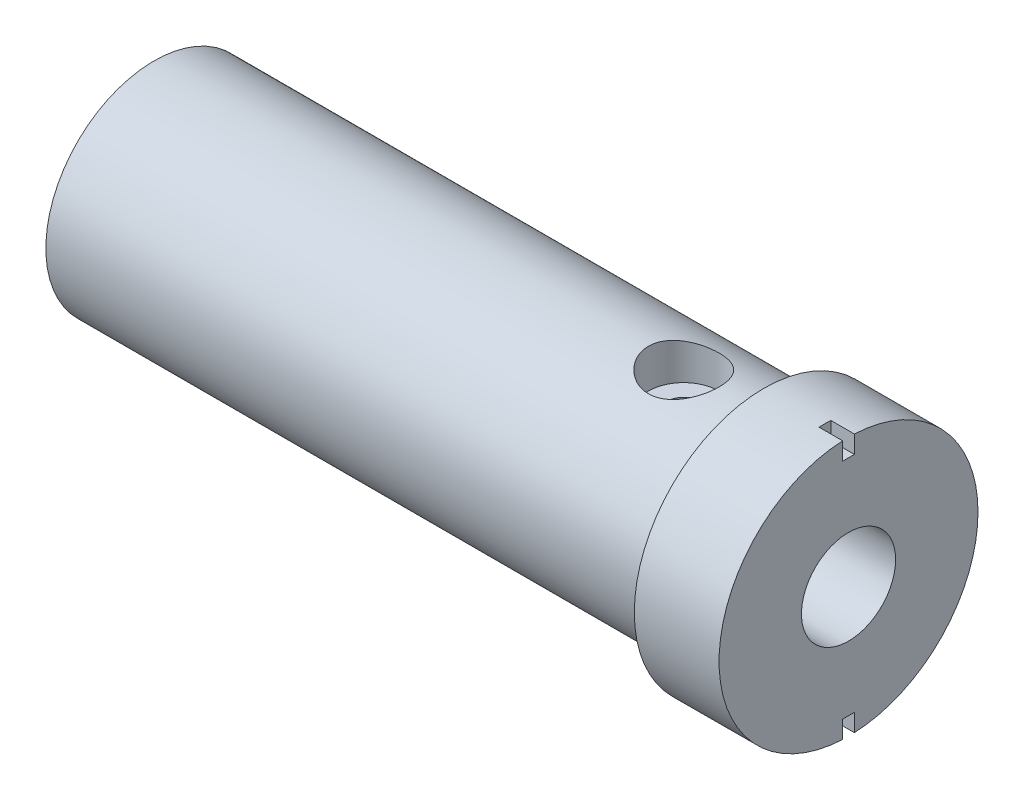
ISO-10303-21;
HEADER;
FILE_DESCRIPTION(('STEP AP214'),'2;1');
FILE_NAME('part.step','',(''),(''),'','','');
FILE_SCHEMA(('AUTOMOTIVE_DESIGN { 1 0 10303 214 1 1 1 1 }'));
ENDSEC;
DATA;
#1=APPLICATION_CONTEXT('core data for automotive mechanical design processes');
#2=APPLICATION_PROTOCOL_DEFINITION('international standard','automotive_design',2000,#1);
#3=PRODUCT_CONTEXT('',#1,'mechanical');
#4=PRODUCT('Part','Part','',(#3));
#5=PRODUCT_RELATED_PRODUCT_CATEGORY('part','',(#4));
#6=PRODUCT_DEFINITION_FORMATION('','',#4);
#7=PRODUCT_DEFINITION_CONTEXT('part definition',#1,'design');
#8=PRODUCT_DEFINITION('design','',#6,#7);
#9=PRODUCT_DEFINITION_SHAPE('','',#8);
#10=(LENGTH_UNIT() NAMED_UNIT(*) SI_UNIT(.MILLI.,.METRE.));
#11=(NAMED_UNIT(*) PLANE_ANGLE_UNIT() SI_UNIT($,.RADIAN.));
#12=(NAMED_UNIT(*) SI_UNIT($,.STERADIAN.) SOLID_ANGLE_UNIT());
#13=UNCERTAINTY_MEASURE_WITH_UNIT(LENGTH_MEASURE(1.E-05),#10,'distance_accuracy_value','');
#14=(GEOMETRIC_REPRESENTATION_CONTEXT(3) GLOBAL_UNCERTAINTY_ASSIGNED_CONTEXT((#13)) GLOBAL_UNIT_ASSIGNED_CONTEXT((#10,
#11,#12)) REPRESENTATION_CONTEXT('',''));
#15=CARTESIAN_POINT('',(0.,0.,0.));
#16=DIRECTION('',(0.,0.,1.));
#17=DIRECTION('',(1.,0.,0.));
#18=AXIS2_PLACEMENT_3D('',#15,#16,#17);
#19=CARTESIAN_POINT('',(0.,0.,0.));
#20=DIRECTION('',(1.,0.,0.));
#21=DIRECTION('',(0.,0.,-1.));
#22=AXIS2_PLACEMENT_3D('',#19,#20,#21);
#23=PLANE('',#22);
#24=CARTESIAN_POINT('',(0.,0.,0.));
#25=DIRECTION('',(1.,0.,0.));
#26=DIRECTION('',(0.,0.,-1.));
#27=AXIS2_PLACEMENT_3D('',#24,#25,#26);
#28=CIRCLE('',#27,4.);
#29=CARTESIAN_POINT('',(0.,0.,-4.));
#30=VERTEX_POINT('',#29);
#31=EDGE_CURVE('E194',#30,#30,#28,.T.);
#32=ORIENTED_EDGE('',*,*,#31,.F.);
#33=EDGE_LOOP('',(#32));
#34=FACE_BOUND('',#33,.T.);
#35=DIRECTION('',(0.,0.,1.));
#36=VECTOR('',#35,1.);
#37=CARTESIAN_POINT('',(0.,9.48863048791795,0.));
#38=LINE('',#37,#36);
#39=CARTESIAN_POINT('',(0.,9.48863048791795,-0.499999999999999));
#40=VERTEX_POINT('',#39);
#41=CARTESIAN_POINT('',(0.,9.48863048791795,0.500000000000001));
#42=VERTEX_POINT('',#41);
#43=EDGE_CURVE('E143',#40,#42,#38,.T.);
#44=ORIENTED_EDGE('',*,*,#43,.T.);
#45=DIRECTION('',(0.,1.,0.));
#46=VECTOR('',#45,1.);
#47=CARTESIAN_POINT('',(0.,0.,0.500000000000001));
#48=LINE('',#47,#46);
#49=CARTESIAN_POINT('',(0.,10.988630487918,0.500000000000001));
#50=VERTEX_POINT('',#49);
#51=EDGE_CURVE('E133',#42,#50,#48,.T.);
#52=ORIENTED_EDGE('',*,*,#51,.T.);
#53=CARTESIAN_POINT('',(0.,0.,0.));
#54=DIRECTION('',(1.,0.,0.));
#55=DIRECTION('',(0.,0.,-1.));
#56=AXIS2_PLACEMENT_3D('',#53,#54,#55);
#57=CIRCLE('',#56,11.);
#58=CARTESIAN_POINT('',(0.,-10.988630487918,0.500000000000001));
#59=VERTEX_POINT('',#58);
#60=EDGE_CURVE('E11',#50,#59,#57,.T.);
#61=ORIENTED_EDGE('',*,*,#60,.T.);
#62=DIRECTION('',(0.,-1.,0.));
#63=VECTOR('',#62,1.);
#64=CARTESIAN_POINT('',(0.,0.,0.500000000000001));
#65=LINE('',#64,#63);
#66=CARTESIAN_POINT('',(0.,-9.48863048791795,0.500000000000001));
#67=VERTEX_POINT('',#66);
#68=EDGE_CURVE('E161',#67,#59,#65,.T.);
#69=ORIENTED_EDGE('',*,*,#68,.F.);
#70=DIRECTION('',(0.,0.,1.));
#71=VECTOR('',#70,1.);
#72=CARTESIAN_POINT('',(0.,-9.48863048791795,0.));
#73=LINE('',#72,#71);
#74=CARTESIAN_POINT('',(0.,-9.48863048791795,-0.499999999999999));
#75=VERTEX_POINT('',#74);
#76=EDGE_CURVE('E171',#75,#67,#73,.T.);
#77=ORIENTED_EDGE('',*,*,#76,.F.);
#78=DIRECTION('',(0.,1.,0.));
#79=VECTOR('',#78,1.);
#80=CARTESIAN_POINT('',(0.,0.,-0.5));
#81=LINE('',#80,#79);
#82=CARTESIAN_POINT('',(0.,-10.988630487918,-0.499999999999999));
#83=VERTEX_POINT('',#82);
#84=EDGE_CURVE('E168',#83,#75,#81,.T.);
#85=ORIENTED_EDGE('',*,*,#84,.F.);
#86=CARTESIAN_POINT('',(0.,10.988630487918,-0.499999999999999));
#87=VERTEX_POINT('',#86);
#88=EDGE_CURVE('E49',#83,#87,#57,.T.);
#89=ORIENTED_EDGE('',*,*,#88,.T.);
#90=DIRECTION('',(0.,-1.,0.));
#91=VECTOR('',#90,1.);
#92=CARTESIAN_POINT('',(0.,0.,-0.5));
#93=LINE('',#92,#91);
#94=EDGE_CURVE('E140',#87,#40,#93,.T.);
#95=ORIENTED_EDGE('',*,*,#94,.T.);
#96=EDGE_LOOP('',(#44,#52,#61,#69,#77,#85,#89,#95));
#97=FACE_BOUND('',#96,.T.);
#98=ADVANCED_FACE('F36',(#34,#97),#23,.T.);
#99=CARTESIAN_POINT('',(0.,0.,0.));
#100=DIRECTION('',(1.,0.,0.));
#101=DIRECTION('',(0.,0.,-1.));
#102=AXIS2_PLACEMENT_3D('',#99,#100,#101);
#103=CYLINDRICAL_SURFACE('',#102,11.);
#104=CARTESIAN_POINT('',(-7.2,0.,0.));
#105=DIRECTION('',(1.,0.,0.));
#106=DIRECTION('',(0.,0.,-1.));
#107=AXIS2_PLACEMENT_3D('',#104,#105,#106);
#108=CIRCLE('',#107,11.);
#109=CARTESIAN_POINT('',(-7.2,0.,-11.));
#110=VERTEX_POINT('',#109);
#111=EDGE_CURVE('E214',#110,#110,#108,.T.);
#112=ORIENTED_EDGE('',*,*,#111,.T.);
#113=EDGE_LOOP('',(#112));
#114=FACE_BOUND('',#113,.T.);
#115=ORIENTED_EDGE('',*,*,#60,.F.);
#116=DIRECTION('',(1.,0.,0.));
#117=VECTOR('',#116,1.);
#118=CARTESIAN_POINT('',(-2.,10.988630487918,0.500000000000001));
#119=LINE('',#118,#117);
#120=CARTESIAN_POINT('',(-2.,10.988630487918,0.500000000000001));
#121=VERTEX_POINT('',#120);
#122=EDGE_CURVE('E151',#121,#50,#119,.T.);
#123=ORIENTED_EDGE('',*,*,#122,.F.);
#124=CARTESIAN_POINT('',(-2.,0.,0.));
#125=DIRECTION('',(1.,0.,0.));
#126=DIRECTION('',(0.,0.,-1.));
#127=AXIS2_PLACEMENT_3D('',#124,#125,#126);
#128=CIRCLE('',#127,11.);
#129=CARTESIAN_POINT('',(-2.,10.988630487918,-0.499999999999999));
#130=VERTEX_POINT('',#129);
#131=EDGE_CURVE('E135',#130,#121,#128,.T.);
#132=ORIENTED_EDGE('',*,*,#131,.F.);
#133=DIRECTION('',(1.,0.,0.));
#134=VECTOR('',#133,1.);
#135=CARTESIAN_POINT('',(-2.,10.988630487918,-0.499999999999999));
#136=LINE('',#135,#134);
#137=EDGE_CURVE('E154',#130,#87,#136,.T.);
#138=ORIENTED_EDGE('',*,*,#137,.T.);
#139=ORIENTED_EDGE('',*,*,#88,.F.);
#140=DIRECTION('',(1.,0.,0.));
#141=VECTOR('',#140,1.);
#142=CARTESIAN_POINT('',(-2.,-10.988630487918,-0.499999999999999));
#143=LINE('',#142,#141);
#144=CARTESIAN_POINT('',(-2.,-10.988630487918,-0.499999999999999));
#145=VERTEX_POINT('',#144);
#146=EDGE_CURVE('E167',#145,#83,#143,.T.);
#147=ORIENTED_EDGE('',*,*,#146,.F.);
#148=CARTESIAN_POINT('',(-2.,0.,0.));
#149=DIRECTION('',(1.,0.,0.));
#150=DIRECTION('',(0.,0.,-1.));
#151=AXIS2_PLACEMENT_3D('',#148,#149,#150);
#152=CIRCLE('',#151,11.);
#153=CARTESIAN_POINT('',(-2.,-10.988630487918,0.500000000000001));
#154=VERTEX_POINT('',#153);
#155=EDGE_CURVE('E158',#154,#145,#152,.T.);
#156=ORIENTED_EDGE('',*,*,#155,.F.);
#157=DIRECTION('',(1.,0.,0.));
#158=VECTOR('',#157,1.);
#159=CARTESIAN_POINT('',(-2.,-10.988630487918,0.500000000000001));
#160=LINE('',#159,#158);
#161=EDGE_CURVE('E149',#154,#59,#160,.T.);
#162=ORIENTED_EDGE('',*,*,#161,.T.);
#163=EDGE_LOOP('',(#115,#123,#132,#138,#139,#147,#156,#162));
#164=FACE_BOUND('',#163,.T.);
#165=ADVANCED_FACE('F224',(#114,#164),#103,.T.);
#166=CARTESIAN_POINT('',(-21.,3.1,0.));
#167=DIRECTION('',(0.,-1.,0.));
#168=DIRECTION('',(0.,0.,-1.));
#169=AXIS2_PLACEMENT_3D('',#166,#167,#168);
#170=PLANE('',#169);
#171=CARTESIAN_POINT('',(-14.,3.1,0.));
#172=DIRECTION('',(0.,-1.,0.));
#173=DIRECTION('',(0.,0.,-1.));
#174=AXIS2_PLACEMENT_3D('',#171,#172,#173);
#175=CIRCLE('',#174,1.475);
#176=CARTESIAN_POINT('',(-14.,3.1,-1.475));
#177=VERTEX_POINT('',#176);
#178=EDGE_CURVE('E187',#177,#177,#175,.T.);
#179=ORIENTED_EDGE('',*,*,#178,.F.);
#180=EDGE_LOOP('',(#179));
#181=FACE_BOUND('',#180,.T.);
#182=DIRECTION('',(1.,0.,0.));
#183=VECTOR('',#182,1.);
#184=CARTESIAN_POINT('',(-21.,3.1,-2.52784493195291));
#185=LINE('',#184,#183);
#186=CARTESIAN_POINT('',(-21.,3.1,-2.52784493195291));
#187=VERTEX_POINT('',#186);
#188=CARTESIAN_POINT('',(-2.,3.1,-2.52784493195291));
#189=VERTEX_POINT('',#188);
#190=EDGE_CURVE('E200',#187,#189,#185,.T.);
#191=ORIENTED_EDGE('',*,*,#190,.T.);
#192=DIRECTION('',(0.,0.,-1.));
#193=VECTOR('',#192,1.);
#194=CARTESIAN_POINT('',(-2.,3.1,0.));
#195=LINE('',#194,#193);
#196=CARTESIAN_POINT('',(-2.00000000000001,3.1,2.52784493195291));
#197=VERTEX_POINT('',#196);
#198=EDGE_CURVE('E190',#197,#189,#195,.T.);
#199=ORIENTED_EDGE('',*,*,#198,.F.);
#200=DIRECTION('',(1.,0.,0.));
#201=VECTOR('',#200,1.);
#202=CARTESIAN_POINT('',(-21.,3.1,2.52784493195291));
#203=LINE('',#202,#201);
#204=CARTESIAN_POINT('',(-21.,3.1,2.52784493195291));
#205=VERTEX_POINT('',#204);
#206=EDGE_CURVE('E203',#205,#197,#203,.T.);
#207=ORIENTED_EDGE('',*,*,#206,.F.);
#208=DIRECTION('',(0.,0.,-1.));
#209=VECTOR('',#208,1.);
#210=CARTESIAN_POINT('',(-21.,3.1,0.));
#211=LINE('',#210,#209);
#212=EDGE_CURVE('E198',#205,#187,#211,.T.);
#213=ORIENTED_EDGE('',*,*,#212,.T.);
#214=EDGE_LOOP('',(#191,#199,#207,#213));
#215=FACE_BOUND('',#214,.T.);
#216=ADVANCED_FACE('F251',(#181,#215),#170,.T.);
#217=CARTESIAN_POINT('',(-7.2,0.,-11.));
#218=DIRECTION('',(-1.,0.,0.));
#219=DIRECTION('',(0.,0.,1.));
#220=AXIS2_PLACEMENT_3D('',#217,#218,#219);
#221=PLANE('',#220);
#222=CARTESIAN_POINT('',(-7.2,0.,0.));
#223=DIRECTION('',(1.,0.,0.));
#224=DIRECTION('',(0.,0.,-1.));
#225=AXIS2_PLACEMENT_3D('',#222,#223,#224);
#226=CIRCLE('',#225,9.2);
#227=CARTESIAN_POINT('',(-7.2,0.,-9.2));
#228=VERTEX_POINT('',#227);
#229=EDGE_CURVE('E211',#228,#228,#226,.T.);
#230=ORIENTED_EDGE('',*,*,#229,.T.);
#231=EDGE_LOOP('',(#230));
#232=FACE_BOUND('',#231,.T.);
#233=ORIENTED_EDGE('',*,*,#111,.F.);
#234=EDGE_LOOP('',(#233));
#235=FACE_BOUND('',#234,.T.);
#236=ADVANCED_FACE('F280',(#232,#235),#221,.T.);
#237=CARTESIAN_POINT('',(0.,0.,0.));
#238=DIRECTION('',(1.,0.,0.));
#239=DIRECTION('',(0.,0.,-1.));
#240=AXIS2_PLACEMENT_3D('',#237,#238,#239);
#241=CYLINDRICAL_SURFACE('',#240,9.19999999999999);
#242=CARTESIAN_POINT('',(-14.,8.69712596206355,-3.));
#243=CARTESIAN_POINT('',(-14.1636280358255,8.69712602561283,-3.00000006948844));
#244=CARTESIAN_POINT('',(-14.3272570951127,8.70179420906425,-2.98656760005086));
#245=CARTESIAN_POINT('',(-14.6496818341707,8.7198707417757,-2.93336401551207));
#246=CARTESIAN_POINT('',(-14.8084765350284,8.73328084903519,-2.89358760262238));
#247=CARTESIAN_POINT('',(-15.1165119476742,8.76716430876783,-2.78923030719512));
#248=CARTESIAN_POINT('',(-15.2657701134439,8.78762429226838,-2.72469634734532));
#249=CARTESIAN_POINT('',(-15.5513872146714,8.83328304536185,-2.57281482250126));
#250=CARTESIAN_POINT('',(-15.6877434910631,8.85848278863063,-2.48546256857121));
#251=CARTESIAN_POINT('',(-15.9487896804251,8.91183948555475,-2.28692219691646));
#252=CARTESIAN_POINT('',(-16.0729260556745,8.94006780908053,-2.17502527730267));
#253=CARTESIAN_POINT('',(-16.3010465897289,8.99569637021583,-1.93208603100607));
#254=CARTESIAN_POINT('',(-16.4050276666717,9.02309648064696,-1.80104078179667));
#255=CARTESIAN_POINT('',(-16.5923730486131,9.07480417137145,-1.51950174610698));
#256=CARTESIAN_POINT('',(-16.6751608891587,9.09901799471419,-1.36860562348149));
#257=CARTESIAN_POINT('',(-16.8139621663094,9.14078660779368,-1.05410527392676));
#258=CARTESIAN_POINT('',(-16.8699824895143,9.15834311004922,-0.890504328230102));
#259=CARTESIAN_POINT('',(-16.9517916678518,9.18431353905577,-0.561039311526713));
#260=CARTESIAN_POINT('',(-16.978528010398,9.19301331783793,-0.395433460298396));
#261=CARTESIAN_POINT('',(-17.0040191771576,9.2013029471673,-0.0618729536399199));
#262=CARTESIAN_POINT('',(-17.0027809107984,9.20089504721341,0.106081111564881));
#263=CARTESIAN_POINT('',(-16.9729669050479,9.19121087856134,0.432877467383251));
#264=CARTESIAN_POINT('',(-16.9454195698059,9.18226823639605,0.591825072105986));
#265=CARTESIAN_POINT('',(-16.8654653636474,9.15693522813862,0.90270371353502));
#266=CARTESIAN_POINT('',(-16.8130568279354,9.1405443632898,1.0546342796074));
#267=CARTESIAN_POINT('',(-16.6842463234534,9.10172363407732,1.34945857551705));
#268=CARTESIAN_POINT('',(-16.6075448709107,9.07921891922917,1.49221119656913));
#269=CARTESIAN_POINT('',(-16.4325702225646,9.03052321490297,1.76312900882243));
#270=CARTESIAN_POINT('',(-16.3342912140292,9.00433123280328,1.8912902551296));
#271=CARTESIAN_POINT('',(-16.1137339327142,8.94963510368291,2.13551054636341));
#272=CARTESIAN_POINT('',(-15.9905720673065,8.92107995667197,2.25076133825675));
#273=CARTESIAN_POINT('',(-15.7264169773515,8.86588177281267,2.45922724376976));
#274=CARTESIAN_POINT('',(-15.5854212493852,8.8392390052382,2.55243925842673));
#275=CARTESIAN_POINT('',(-15.2871385440113,8.79061060372585,2.71523620605493));
#276=CARTESIAN_POINT('',(-15.1296620452021,8.76869067896904,2.78449500230246));
#277=CARTESIAN_POINT('',(-14.8043896798805,8.73275371918737,2.89524477566101));
#278=CARTESIAN_POINT('',(-14.6365979456122,8.71873354214059,2.93674679389927));
#279=CARTESIAN_POINT('',(-14.3032574416781,8.70088969109624,2.98919004884247));
#280=CARTESIAN_POINT('',(-14.137927172899,8.69665004268403,3.00137901368447));
#281=CARTESIAN_POINT('',(-13.8075631701979,8.69768729156416,2.99837337293999));
#282=CARTESIAN_POINT('',(-13.6425293902187,8.70296255434456,2.98318347061216));
#283=CARTESIAN_POINT('',(-13.3230098573138,8.72202193994362,2.92697036189824));
#284=CARTESIAN_POINT('',(-13.1683555914896,8.73552500390931,2.88679959741978));
#285=CARTESIAN_POINT('',(-12.868008509431,8.76921338217084,2.78278011008459));
#286=CARTESIAN_POINT('',(-12.7223172431005,8.7893998483471,2.71892730541411));
#287=CARTESIAN_POINT('',(-12.4390828517378,8.83494779646293,2.56712739933201));
#288=CARTESIAN_POINT('',(-12.3019266191577,8.8604489949994,2.47850145430636));
#289=CARTESIAN_POINT('',(-12.0439804013709,8.91347559935073,2.28044848294344));
#290=CARTESIAN_POINT('',(-11.923195056142,8.94100157564942,2.17101558034839));
#291=CARTESIAN_POINT('',(-11.6957153843372,8.99649879773837,1.92850982824102));
#292=CARTESIAN_POINT('',(-11.5899178019309,9.02443286130206,1.79458489750842));
#293=CARTESIAN_POINT('',(-11.4022479110387,9.07635176949049,1.51019887066399));
#294=CARTESIAN_POINT('',(-11.3203746529421,9.10033677084597,1.35973843121036));
#295=CARTESIAN_POINT('',(-11.1836432183854,9.1415331876694,1.04737228527324));
#296=CARTESIAN_POINT('',(-11.1286009095256,9.15879060371627,0.885553564855847));
#297=CARTESIAN_POINT('',(-11.0467222583125,9.18478757011083,0.554286640438633));
#298=CARTESIAN_POINT('',(-11.0198762193927,9.19353004863087,0.384841080192689));
#299=CARTESIAN_POINT('',(-10.9959951676416,9.20130058724371,0.0513507308213604));
#300=CARTESIAN_POINT('',(-10.9976701153204,9.20074903984763,-0.112592918733419));
#301=CARTESIAN_POINT('',(-11.0276234310136,9.19101860788011,-0.437754965054963));
#302=CARTESIAN_POINT('',(-11.0558997951345,9.18184037315992,-0.598973566169313));
#303=CARTESIAN_POINT('',(-11.1374089151614,9.1560347195712,-0.911768497880309));
#304=CARTESIAN_POINT('',(-11.1902700922902,9.13951837084227,-1.06345146731182));
#305=CARTESIAN_POINT('',(-11.3191075264461,9.1007374974658,-1.35585956495554));
#306=CARTESIAN_POINT('',(-11.3950878983052,9.07847194966336,-1.4965827369017));
#307=CARTESIAN_POINT('',(-11.571154364283,9.02950168220742,-1.76858430385069));
#308=CARTESIAN_POINT('',(-11.6720083703938,9.00266622521187,-1.8993418037466));
#309=CARTESIAN_POINT('',(-11.8936361470826,8.94791896179727,-2.14250077887531));
#310=CARTESIAN_POINT('',(-12.0144161334519,8.92000682160158,-2.25489650441818));
#311=CARTESIAN_POINT('',(-12.2778138088629,8.86503012273927,-2.46235668401022));
#312=CARTESIAN_POINT('',(-12.4210739901892,8.8380351013346,-2.55662631922266));
#313=CARTESIAN_POINT('',(-12.7222350444542,8.78923590884106,-2.71967131657978));
#314=CARTESIAN_POINT('',(-12.8801313064778,8.76743011062269,-2.78845467396348));
#315=CARTESIAN_POINT('',(-13.1964816367645,8.73283625684646,-2.89491464128439));
#316=CARTESIAN_POINT('',(-13.3543446016538,8.71958920178867,-2.934197314077));
#317=CARTESIAN_POINT('',(-13.6748056876588,8.70173534997871,-2.9867359611419));
#318=CARTESIAN_POINT('',(-13.8374023385231,8.69712589891445,-2.99999993094914));
#319=CARTESIAN_POINT('',(-14.,8.69712596206355,-3.));
#320=B_SPLINE_CURVE_WITH_KNOTS('',3,(#242,#243,#244,#245,#246,#247,#248,#249,#250,#251,#252,
#253,#254,#255,#256,#257,#258,#259,#260,#261,#262,#263,#264,#265,#266,#267,#268,#269,#270,#271,
#272,#273,#274,#275,#276,#277,#278,#279,#280,#281,#282,#283,#284,#285,#286,#287,#288,#289,#290,
#291,#292,#293,#294,#295,#296,#297,#298,#299,#300,#301,#302,#303,#304,#305,#306,#307,#308,#309,
#310,#311,#312,#313,#314,#315,#316,#317,#318,#319),.UNSPECIFIED.,.T.,.F.,(4,2,2,2,2,2,2,2,2,2,2,
2,2,2,2,2,2,2,2,2,2,2,2,2,2,2,2,2,2,2,2,2,2,2,2,2,2,2,4),(0.,0.490282515204811,
0.980663656572736,1.47011993962961,1.9596768803839,2.46586129965627,2.97212305651692,
3.49096398502884,4.00967135703011,4.51104899920584,5.01230280785484,5.49473204934623,
5.97719360059669,6.46585099045065,6.95464018055548,7.46551015601591,7.97645192433022,
8.49409929484988,9.01154063226241,9.50653342702693,10.0014411979209,10.480323237867,
10.9592878558497,11.4529407663323,11.9467333008874,12.4631024813133,12.9794511630885,
13.4922045912555,14.0047816281003,14.4942383091859,14.9836581222892,15.4659098542283,
15.9482474692103,16.4479124063776,16.9477335068034,17.4660419863822,17.9841877307132,
18.4715326954798,18.9587278758969),.UNSPECIFIED.);
#321=CARTESIAN_POINT('',(-14.,8.69712596206355,-3.));
#322=VERTEX_POINT('',#321);
#323=EDGE_CURVE('E39',#322,#322,#320,.T.);
#324=ORIENTED_EDGE('',*,*,#323,.F.);
#325=EDGE_LOOP('',(#324));
#326=FACE_BOUND('',#325,.T.);
#327=CARTESIAN_POINT('',(-59.,0.,0.));
#328=DIRECTION('',(1.,0.,0.));
#329=DIRECTION('',(0.,0.,-1.));
#330=AXIS2_PLACEMENT_3D('',#327,#328,#329);
#331=CIRCLE('',#330,9.19999999999999);
#332=CARTESIAN_POINT('',(-59.,0.,-9.19999999999999));
#333=VERTEX_POINT('',#332);
#334=EDGE_CURVE('E206',#333,#333,#331,.T.);
#335=ORIENTED_EDGE('',*,*,#334,.T.);
#336=EDGE_LOOP('',(#335));
#337=FACE_BOUND('',#336,.T.);
#338=ORIENTED_EDGE('',*,*,#229,.F.);
#339=EDGE_LOOP('',(#338));
#340=FACE_BOUND('',#339,.T.);
#341=ADVANCED_FACE('F284',(#326,#337,#340),#241,.T.);
#342=CARTESIAN_POINT('',(-59.,0.,-9.19999999999999));
#343=DIRECTION('',(-1.,0.,0.));
#344=DIRECTION('',(0.,0.,1.));
#345=AXIS2_PLACEMENT_3D('',#342,#343,#344);
#346=PLANE('',#345);
#347=ORIENTED_EDGE('',*,*,#334,.F.);
#348=EDGE_LOOP('',(#347));
#349=FACE_BOUND('',#348,.T.);
#350=ADVANCED_FACE('F259',(#349),#346,.T.);
#351=CARTESIAN_POINT('',(-21.,0.,0.));
#352=DIRECTION('',(1.,0.,0.));
#353=DIRECTION('',(0.,0.,-1.));
#354=AXIS2_PLACEMENT_3D('',#351,#352,#353);
#355=CYLINDRICAL_SURFACE('',#354,4.);
#356=ORIENTED_EDGE('',*,*,#31,.T.);
#357=EDGE_LOOP('',(#356));
#358=FACE_BOUND('',#357,.T.);
#359=CARTESIAN_POINT('',(-2.,0.,0.));
#360=DIRECTION('',(1.,0.,0.));
#361=DIRECTION('',(0.,0.,-1.));
#362=AXIS2_PLACEMENT_3D('',#359,#360,#361);
#363=CIRCLE('',#362,4.);
#364=EDGE_CURVE('E192',#189,#197,#363,.T.);
#365=ORIENTED_EDGE('',*,*,#364,.F.);
#366=ORIENTED_EDGE('',*,*,#190,.F.);
#367=CARTESIAN_POINT('',(-21.,0.,0.));
#368=DIRECTION('',(1.,0.,0.));
#369=DIRECTION('',(0.,0.,-1.));
#370=AXIS2_PLACEMENT_3D('',#367,#368,#369);
#371=CIRCLE('',#370,4.);
#372=EDGE_CURVE('E195',#205,#187,#371,.T.);
#373=ORIENTED_EDGE('',*,*,#372,.F.);
#374=ORIENTED_EDGE('',*,*,#206,.T.);
#375=EDGE_LOOP('',(#365,#366,#373,#374));
#376=FACE_BOUND('',#375,.T.);
#377=ADVANCED_FACE('F255',(#358,#376),#355,.F.);
#378=CARTESIAN_POINT('',(-21.,0.,0.));
#379=DIRECTION('',(1.,0.,0.));
#380=DIRECTION('',(0.,0.,-1.));
#381=AXIS2_PLACEMENT_3D('',#378,#379,#380);
#382=PLANE('',#381);
#383=ORIENTED_EDGE('',*,*,#372,.T.);
#384=ORIENTED_EDGE('',*,*,#212,.F.);
#385=EDGE_LOOP('',(#383,#384));
#386=FACE_BOUND('',#385,.T.);
#387=ADVANCED_FACE('F258',(#386),#382,.T.);
#388=CARTESIAN_POINT('',(-2.,0.,0.));
#389=DIRECTION('',(1.,0.,0.));
#390=DIRECTION('',(0.,0.,-1.));
#391=AXIS2_PLACEMENT_3D('',#388,#389,#390);
#392=PLANE('',#391);
#393=ORIENTED_EDGE('',*,*,#198,.T.);
#394=ORIENTED_EDGE('',*,*,#364,.T.);
#395=EDGE_LOOP('',(#393,#394));
#396=FACE_BOUND('',#395,.T.);
#397=ADVANCED_FACE('F270',(#396),#392,.T.);
#398=CARTESIAN_POINT('',(-14.,11.,0.));
#399=DIRECTION('',(0.,-1.,0.));
#400=DIRECTION('',(0.,0.,-1.));
#401=AXIS2_PLACEMENT_3D('',#398,#399,#400);
#402=CYLINDRICAL_SURFACE('',#401,1.475);
#403=CARTESIAN_POINT('',(-14.,5.9,0.));
#404=DIRECTION('',(0.,-1.,0.));
#405=DIRECTION('',(0.,0.,-1.));
#406=AXIS2_PLACEMENT_3D('',#403,#404,#405);
#407=CIRCLE('',#406,1.475);
#408=CARTESIAN_POINT('',(-14.,5.9,-1.475));
#409=VERTEX_POINT('',#408);
#410=EDGE_CURVE('E153',#409,#409,#407,.T.);
#411=ORIENTED_EDGE('',*,*,#410,.F.);
#412=EDGE_LOOP('',(#411));
#413=FACE_BOUND('',#412,.T.);
#414=ORIENTED_EDGE('',*,*,#178,.T.);
#415=EDGE_LOOP('',(#414));
#416=FACE_BOUND('',#415,.T.);
#417=ADVANCED_FACE('F275',(#413,#416),#402,.F.);
#418=CARTESIAN_POINT('',(-14.,11.,0.));
#419=DIRECTION('',(0.,-1.,0.));
#420=DIRECTION('',(0.,0.,-1.));
#421=AXIS2_PLACEMENT_3D('',#418,#419,#420);
#422=CYLINDRICAL_SURFACE('',#421,3.);
#423=ORIENTED_EDGE('',*,*,#323,.T.);
#424=EDGE_LOOP('',(#423));
#425=FACE_BOUND('',#424,.T.);
#426=CARTESIAN_POINT('',(-14.,5.9,0.));
#427=DIRECTION('',(0.,-1.,0.));
#428=DIRECTION('',(0.,0.,-1.));
#429=AXIS2_PLACEMENT_3D('',#426,#427,#428);
#430=CIRCLE('',#429,3.);
#431=CARTESIAN_POINT('',(-14.,5.9,-3.));
#432=VERTEX_POINT('',#431);
#433=EDGE_CURVE('E184',#432,#432,#430,.T.);
#434=ORIENTED_EDGE('',*,*,#433,.T.);
#435=EDGE_LOOP('',(#434));
#436=FACE_BOUND('',#435,.T.);
#437=ADVANCED_FACE('F344',(#425,#436),#422,.F.);
#438=CARTESIAN_POINT('',(-14.,5.9,0.));
#439=DIRECTION('',(0.,-1.,0.));
#440=DIRECTION('',(0.,0.,-1.));
#441=AXIS2_PLACEMENT_3D('',#438,#439,#440);
#442=PLANE('',#441);
#443=ORIENTED_EDGE('',*,*,#410,.T.);
#444=EDGE_LOOP('',(#443));
#445=FACE_BOUND('',#444,.T.);
#446=ORIENTED_EDGE('',*,*,#433,.F.);
#447=EDGE_LOOP('',(#446));
#448=FACE_BOUND('',#447,.T.);
#449=ADVANCED_FACE('F350',(#445,#448),#442,.F.);
#450=CARTESIAN_POINT('',(-2.,0.,0.500000000000001));
#451=DIRECTION('',(0.,0.,1.));
#452=DIRECTION('',(1.,0.,0.));
#453=AXIS2_PLACEMENT_3D('',#450,#451,#452);
#454=PLANE('',#453);
#455=ORIENTED_EDGE('',*,*,#68,.T.);
#456=ORIENTED_EDGE('',*,*,#161,.F.);
#457=DIRECTION('',(0.,-1.,0.));
#458=VECTOR('',#457,1.);
#459=CARTESIAN_POINT('',(-2.,0.,0.500000000000001));
#460=LINE('',#459,#458);
#461=CARTESIAN_POINT('',(-2.,-9.48863048791795,0.500000000000001));
#462=VERTEX_POINT('',#461);
#463=EDGE_CURVE('E64',#462,#154,#460,.T.);
#464=ORIENTED_EDGE('',*,*,#463,.F.);
#465=DIRECTION('',(1.,0.,0.));
#466=VECTOR('',#465,1.);
#467=CARTESIAN_POINT('',(-2.,-9.48863048791795,0.500000000000001));
#468=LINE('',#467,#466);
#469=EDGE_CURVE('E177',#462,#67,#468,.T.);
#470=ORIENTED_EDGE('',*,*,#469,.T.);
#471=EDGE_LOOP('',(#455,#456,#464,#470));
#472=FACE_BOUND('',#471,.T.);
#473=ADVANCED_FACE('F230',(#472),#454,.F.);
#474=CARTESIAN_POINT('',(-2.,-9.48863048791795,0.));
#475=DIRECTION('',(0.,1.,0.));
#476=DIRECTION('',(0.,0.,1.));
#477=AXIS2_PLACEMENT_3D('',#474,#475,#476);
#478=PLANE('',#477);
#479=ORIENTED_EDGE('',*,*,#76,.T.);
#480=ORIENTED_EDGE('',*,*,#469,.F.);
#481=DIRECTION('',(0.,0.,1.));
#482=VECTOR('',#481,1.);
#483=CARTESIAN_POINT('',(-2.,-9.48863048791795,0.));
#484=LINE('',#483,#482);
#485=CARTESIAN_POINT('',(-2.,-9.48863048791795,-0.499999999999999));
#486=VERTEX_POINT('',#485);
#487=EDGE_CURVE('E164',#486,#462,#484,.T.);
#488=ORIENTED_EDGE('',*,*,#487,.F.);
#489=DIRECTION('',(1.,0.,0.));
#490=VECTOR('',#489,1.);
#491=CARTESIAN_POINT('',(-2.,-9.48863048791795,-0.499999999999999));
#492=LINE('',#491,#490);
#493=EDGE_CURVE('E179',#486,#75,#492,.T.);
#494=ORIENTED_EDGE('',*,*,#493,.T.);
#495=EDGE_LOOP('',(#479,#480,#488,#494));
#496=FACE_BOUND('',#495,.T.);
#497=ADVANCED_FACE('F232',(#496),#478,.F.);
#498=CARTESIAN_POINT('',(-2.,0.,-0.5));
#499=DIRECTION('',(0.,0.,-1.));
#500=DIRECTION('',(0.,1.,0.));
#501=AXIS2_PLACEMENT_3D('',#498,#499,#500);
#502=PLANE('',#501);
#503=ORIENTED_EDGE('',*,*,#84,.T.);
#504=ORIENTED_EDGE('',*,*,#493,.F.);
#505=DIRECTION('',(0.,1.,0.));
#506=VECTOR('',#505,1.);
#507=CARTESIAN_POINT('',(-2.,0.,-0.5));
#508=LINE('',#507,#506);
#509=EDGE_CURVE('E160',#145,#486,#508,.T.);
#510=ORIENTED_EDGE('',*,*,#509,.F.);
#511=ORIENTED_EDGE('',*,*,#146,.T.);
#512=EDGE_LOOP('',(#503,#504,#510,#511));
#513=FACE_BOUND('',#512,.T.);
#514=ADVANCED_FACE('F235',(#513),#502,.F.);
#515=CARTESIAN_POINT('',(-2.,0.,0.));
#516=DIRECTION('',(1.,0.,0.));
#517=DIRECTION('',(0.,0.,-1.));
#518=AXIS2_PLACEMENT_3D('',#515,#516,#517);
#519=PLANE('',#518);
#520=ORIENTED_EDGE('',*,*,#155,.T.);
#521=ORIENTED_EDGE('',*,*,#509,.T.);
#522=ORIENTED_EDGE('',*,*,#487,.T.);
#523=ORIENTED_EDGE('',*,*,#463,.T.);
#524=EDGE_LOOP('',(#520,#521,#522,#523));
#525=FACE_BOUND('',#524,.T.);
#526=ADVANCED_FACE('F236',(#525),#519,.T.);
#527=CARTESIAN_POINT('',(-2.,0.,0.500000000000001));
#528=DIRECTION('',(0.,0.,-1.));
#529=DIRECTION('',(-1.,0.,0.));
#530=AXIS2_PLACEMENT_3D('',#527,#528,#529);
#531=PLANE('',#530);
#532=ORIENTED_EDGE('',*,*,#51,.F.);
#533=DIRECTION('',(1.,0.,0.));
#534=VECTOR('',#533,1.);
#535=CARTESIAN_POINT('',(-2.,9.48863048791795,0.500000000000001));
#536=LINE('',#535,#534);
#537=CARTESIAN_POINT('',(-2.,9.48863048791795,0.500000000000001));
#538=VERTEX_POINT('',#537);
#539=EDGE_CURVE('E124',#538,#42,#536,.T.);
#540=ORIENTED_EDGE('',*,*,#539,.F.);
#541=DIRECTION('',(0.,1.,0.));
#542=VECTOR('',#541,1.);
#543=CARTESIAN_POINT('',(-2.,0.,0.500000000000001));
#544=LINE('',#543,#542);
#545=EDGE_CURVE('E128',#538,#121,#544,.T.);
#546=ORIENTED_EDGE('',*,*,#545,.T.);
#547=ORIENTED_EDGE('',*,*,#122,.T.);
#548=EDGE_LOOP('',(#532,#540,#546,#547));
#549=FACE_BOUND('',#548,.T.);
#550=ADVANCED_FACE('F131',(#549),#531,.T.);
#551=CARTESIAN_POINT('',(-2.,0.,-0.5));
#552=DIRECTION('',(0.,0.,1.));
#553=DIRECTION('',(0.,-1.,0.));
#554=AXIS2_PLACEMENT_3D('',#551,#552,#553);
#555=PLANE('',#554);
#556=ORIENTED_EDGE('',*,*,#94,.F.);
#557=ORIENTED_EDGE('',*,*,#137,.F.);
#558=DIRECTION('',(0.,-1.,0.));
#559=VECTOR('',#558,1.);
#560=CARTESIAN_POINT('',(-2.,0.,-0.5));
#561=LINE('',#560,#559);
#562=CARTESIAN_POINT('',(-2.,9.48863048791795,-0.499999999999999));
#563=VERTEX_POINT('',#562);
#564=EDGE_CURVE('E56',#130,#563,#561,.T.);
#565=ORIENTED_EDGE('',*,*,#564,.T.);
#566=DIRECTION('',(1.,0.,0.));
#567=VECTOR('',#566,1.);
#568=CARTESIAN_POINT('',(-2.,9.48863048791795,-0.499999999999999));
#569=LINE('',#568,#567);
#570=EDGE_CURVE('E126',#563,#40,#569,.T.);
#571=ORIENTED_EDGE('',*,*,#570,.T.);
#572=EDGE_LOOP('',(#556,#557,#565,#571));
#573=FACE_BOUND('',#572,.T.);
#574=ADVANCED_FACE('F227',(#573),#555,.T.);
#575=CARTESIAN_POINT('',(-2.,9.48863048791795,0.));
#576=DIRECTION('',(0.,1.,0.));
#577=DIRECTION('',(0.,0.,1.));
#578=AXIS2_PLACEMENT_3D('',#575,#576,#577);
#579=PLANE('',#578);
#580=ORIENTED_EDGE('',*,*,#43,.F.);
#581=ORIENTED_EDGE('',*,*,#570,.F.);
#582=DIRECTION('',(0.,0.,1.));
#583=VECTOR('',#582,1.);
#584=CARTESIAN_POINT('',(-2.,9.48863048791795,0.));
#585=LINE('',#584,#583);
#586=EDGE_CURVE('E120',#563,#538,#585,.T.);
#587=ORIENTED_EDGE('',*,*,#586,.T.);
#588=ORIENTED_EDGE('',*,*,#539,.T.);
#589=EDGE_LOOP('',(#580,#581,#587,#588));
#590=FACE_BOUND('',#589,.T.);
#591=ADVANCED_FACE('F123',(#590),#579,.T.);
#592=CARTESIAN_POINT('',(-2.,0.,0.));
#593=DIRECTION('',(1.,0.,0.));
#594=DIRECTION('',(0.,0.,-1.));
#595=AXIS2_PLACEMENT_3D('',#592,#593,#594);
#596=PLANE('',#595);
#597=ORIENTED_EDGE('',*,*,#545,.F.);
#598=ORIENTED_EDGE('',*,*,#586,.F.);
#599=ORIENTED_EDGE('',*,*,#564,.F.);
#600=ORIENTED_EDGE('',*,*,#131,.T.);
#601=EDGE_LOOP('',(#597,#598,#599,#600));
#602=FACE_BOUND('',#601,.T.);
#603=ADVANCED_FACE('F137',(#602),#596,.T.);
#604=CLOSED_SHELL('',(#98,#165,#216,#236,#341,#350,#377,#387,#397,#417,#437,#449,#473,#497,#514,
#526,#550,#574,#591,#603));
#605=MANIFOLD_SOLID_BREP('B2',#604);
#606=ADVANCED_BREP_SHAPE_REPRESENTATION('',(#18,#605),#14);
#607=SHAPE_DEFINITION_REPRESENTATION(#9,#606);
ENDSEC;
END-ISO-10303-21;
